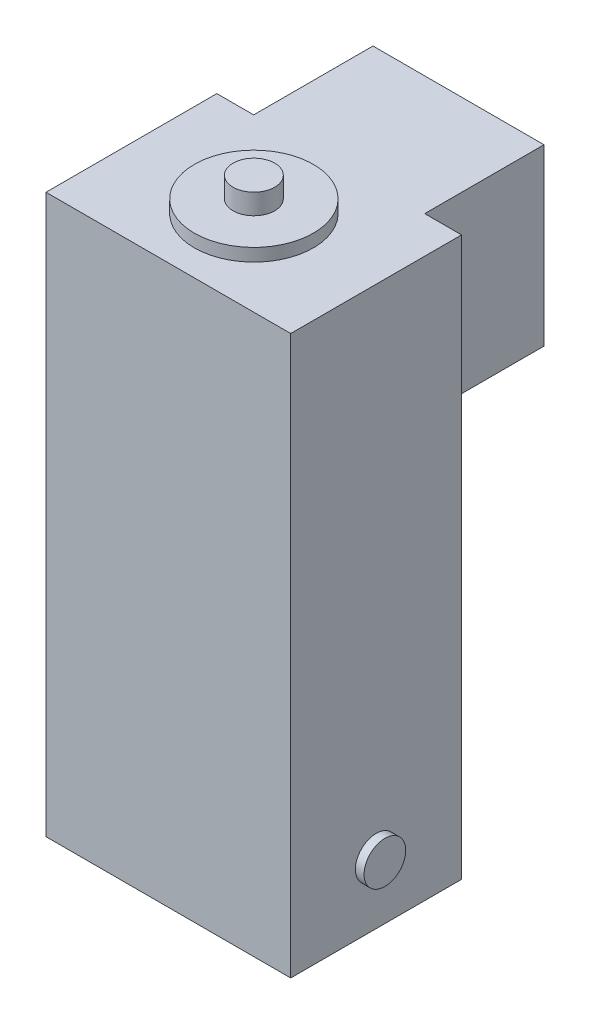
ISO-10303-21;
HEADER;
FILE_DESCRIPTION(('STEP AP214'),'2;1');
FILE_NAME('part.step','',(''),(''),'','','');
FILE_SCHEMA(('AUTOMOTIVE_DESIGN { 1 0 10303 214 1 1 1 1 }'));
ENDSEC;
DATA;
#1=APPLICATION_CONTEXT('core data for automotive mechanical design processes');
#2=APPLICATION_PROTOCOL_DEFINITION('international standard','automotive_design',2000,#1);
#3=PRODUCT_CONTEXT('',#1,'mechanical');
#4=PRODUCT('Part','Part','',(#3));
#5=PRODUCT_RELATED_PRODUCT_CATEGORY('part','',(#4));
#6=PRODUCT_DEFINITION_FORMATION('','',#4);
#7=PRODUCT_DEFINITION_CONTEXT('part definition',#1,'design');
#8=PRODUCT_DEFINITION('design','',#6,#7);
#9=PRODUCT_DEFINITION_SHAPE('','',#8);
#10=(LENGTH_UNIT() NAMED_UNIT(*) SI_UNIT(.MILLI.,.METRE.));
#11=(NAMED_UNIT(*) PLANE_ANGLE_UNIT() SI_UNIT($,.RADIAN.));
#12=(NAMED_UNIT(*) SI_UNIT($,.STERADIAN.) SOLID_ANGLE_UNIT());
#13=UNCERTAINTY_MEASURE_WITH_UNIT(LENGTH_MEASURE(1.E-05),#10,'distance_accuracy_value','');
#14=(GEOMETRIC_REPRESENTATION_CONTEXT(3) GLOBAL_UNCERTAINTY_ASSIGNED_CONTEXT((#13)) GLOBAL_UNIT_ASSIGNED_CONTEXT((#10,
#11,#12)) REPRESENTATION_CONTEXT('',''));
#15=CARTESIAN_POINT('',(0.,0.,0.));
#16=DIRECTION('',(0.,0.,1.));
#17=DIRECTION('',(1.,0.,0.));
#18=AXIS2_PLACEMENT_3D('',#15,#16,#17);
#19=CARTESIAN_POINT('',(0.,119.7,0.));
#20=DIRECTION('',(0.,1.,0.));
#21=DIRECTION('',(0.,0.,1.));
#22=AXIS2_PLACEMENT_3D('',#19,#20,#21);
#23=PLANE('',#22);
#24=CARTESIAN_POINT('',(0.,119.7,0.));
#25=DIRECTION('',(0.,1.,0.));
#26=DIRECTION('',(0.,0.,1.));
#27=AXIS2_PLACEMENT_3D('',#24,#25,#26);
#28=CIRCLE('',#27,14.);
#29=CARTESIAN_POINT('',(0.,119.7,14.));
#30=VERTEX_POINT('',#29);
#31=EDGE_CURVE('E217',#30,#30,#28,.T.);
#32=ORIENTED_EDGE('',*,*,#31,.T.);
#33=EDGE_LOOP('',(#32));
#34=FACE_BOUND('',#33,.T.);
#35=CARTESIAN_POINT('',(0.,119.7,0.));
#36=DIRECTION('',(0.,1.,0.));
#37=DIRECTION('',(0.,0.,1.));
#38=AXIS2_PLACEMENT_3D('',#35,#36,#37);
#39=CIRCLE('',#38,4.9);
#40=CARTESIAN_POINT('',(0.,119.7,4.9));
#41=VERTEX_POINT('',#40);
#42=EDGE_CURVE('E210',#41,#41,#39,.T.);
#43=ORIENTED_EDGE('',*,*,#42,.F.);
#44=EDGE_LOOP('',(#43));
#45=FACE_BOUND('',#44,.T.);
#46=ADVANCED_FACE('F33',(#34,#45),#23,.T.);
#47=CARTESIAN_POINT('',(-20.1,116.7,13.));
#48=DIRECTION('',(0.,-1.,0.));
#49=DIRECTION('',(0.,0.,-1.));
#50=AXIS2_PLACEMENT_3D('',#47,#48,#49);
#51=PLANE('',#50);
#52=DIRECTION('',(0.,0.,1.));
#53=VECTOR('',#52,1.);
#54=CARTESIAN_POINT('',(-20.1,116.7,-48.1));
#55=LINE('',#54,#53);
#56=CARTESIAN_POINT('',(-20.1,116.7,-48.1));
#57=VERTEX_POINT('',#56);
#58=CARTESIAN_POINT('',(-20.1,116.7,-20.0569195924031));
#59=VERTEX_POINT('',#58);
#60=EDGE_CURVE('E220',#57,#59,#55,.T.);
#61=ORIENTED_EDGE('',*,*,#60,.T.);
#62=DIRECTION('',(-1.,0.,0.));
#63=VECTOR('',#62,1.);
#64=CARTESIAN_POINT('',(-28.7625,116.7,-20.0569195924031));
#65=LINE('',#64,#63);
#66=CARTESIAN_POINT('',(-28.7625,116.7,-20.0569195924031));
#67=VERTEX_POINT('',#66);
#68=EDGE_CURVE('E177',#59,#67,#65,.T.);
#69=ORIENTED_EDGE('',*,*,#68,.T.);
#70=DIRECTION('',(0.,0.,1.));
#71=VECTOR('',#70,1.);
#72=CARTESIAN_POINT('',(-28.7625,116.7,20.1));
#73=LINE('',#72,#71);
#74=CARTESIAN_POINT('',(-28.7625,116.7,20.1));
#75=VERTEX_POINT('',#74);
#76=EDGE_CURVE('E181',#67,#75,#73,.T.);
#77=ORIENTED_EDGE('',*,*,#76,.T.);
#78=DIRECTION('',(1.,0.,0.));
#79=VECTOR('',#78,1.);
#80=CARTESIAN_POINT('',(-28.7625,116.7,20.1));
#81=LINE('',#80,#79);
#82=CARTESIAN_POINT('',(28.7625,116.7,20.1));
#83=VERTEX_POINT('',#82);
#84=EDGE_CURVE('E411',#75,#83,#81,.T.);
#85=ORIENTED_EDGE('',*,*,#84,.T.);
#86=DIRECTION('',(0.,0.,-1.));
#87=VECTOR('',#86,1.);
#88=CARTESIAN_POINT('',(28.7625,116.7,20.1));
#89=LINE('',#88,#87);
#90=CARTESIAN_POINT('',(28.7625,116.7,-20.0569195924031));
#91=VERTEX_POINT('',#90);
#92=EDGE_CURVE('E154',#83,#91,#89,.T.);
#93=ORIENTED_EDGE('',*,*,#92,.T.);
#94=CARTESIAN_POINT('',(20.1,116.7,-20.0569195924031));
#95=VERTEX_POINT('',#94);
#96=EDGE_CURVE('E174',#91,#95,#65,.T.);
#97=ORIENTED_EDGE('',*,*,#96,.T.);
#98=DIRECTION('',(0.,0.,-1.));
#99=VECTOR('',#98,1.);
#100=CARTESIAN_POINT('',(20.1,116.7,-48.1));
#101=LINE('',#100,#99);
#102=CARTESIAN_POINT('',(20.1,116.7,-48.1));
#103=VERTEX_POINT('',#102);
#104=EDGE_CURVE('E235',#95,#103,#101,.T.);
#105=ORIENTED_EDGE('',*,*,#104,.T.);
#106=DIRECTION('',(-1.,0.,0.));
#107=VECTOR('',#106,1.);
#108=CARTESIAN_POINT('',(20.1,116.7,-48.1));
#109=LINE('',#108,#107);
#110=EDGE_CURVE('E227',#103,#57,#109,.T.);
#111=ORIENTED_EDGE('',*,*,#110,.T.);
#112=EDGE_LOOP('',(#61,#69,#77,#85,#93,#97,#105,#111));
#113=FACE_BOUND('',#112,.T.);
#114=CARTESIAN_POINT('',(0.,116.7,0.));
#115=DIRECTION('',(0.,1.,0.));
#116=DIRECTION('',(0.,0.,1.));
#117=AXIS2_PLACEMENT_3D('',#114,#115,#116);
#118=CIRCLE('',#117,14.);
#119=CARTESIAN_POINT('',(0.,116.7,14.));
#120=VERTEX_POINT('',#119);
#121=EDGE_CURVE('E214',#120,#120,#118,.T.);
#122=ORIENTED_EDGE('',*,*,#121,.F.);
#123=EDGE_LOOP('',(#122));
#124=FACE_BOUND('',#123,.T.);
#125=ADVANCED_FACE('F309',(#113,#124),#51,.F.);
#126=CARTESIAN_POINT('',(20.1,75.7,-48.1));
#127=DIRECTION('',(1.,0.,0.));
#128=DIRECTION('',(0.,0.,-1.));
#129=AXIS2_PLACEMENT_3D('',#126,#127,#128);
#130=PLANE('',#129);
#131=DIRECTION('',(0.,1.,0.));
#132=VECTOR('',#131,1.);
#133=CARTESIAN_POINT('',(20.1,75.7,-20.0569195924031));
#134=LINE('',#133,#132);
#135=CARTESIAN_POINT('',(20.1,75.7,-20.0569195924031));
#136=VERTEX_POINT('',#135);
#137=EDGE_CURVE('E194',#136,#95,#134,.T.);
#138=ORIENTED_EDGE('',*,*,#137,.F.);
#139=DIRECTION('',(0.,0.,-1.));
#140=VECTOR('',#139,1.);
#141=CARTESIAN_POINT('',(20.1,75.7,-48.1));
#142=LINE('',#141,#140);
#143=CARTESIAN_POINT('',(20.1,75.7,-48.1));
#144=VERTEX_POINT('',#143);
#145=EDGE_CURVE('E226',#136,#144,#142,.T.);
#146=ORIENTED_EDGE('',*,*,#145,.T.);
#147=DIRECTION('',(0.,1.,0.));
#148=VECTOR('',#147,1.);
#149=CARTESIAN_POINT('',(20.1,75.7,-48.1));
#150=LINE('',#149,#148);
#151=EDGE_CURVE('E232',#144,#103,#150,.T.);
#152=ORIENTED_EDGE('',*,*,#151,.T.);
#153=ORIENTED_EDGE('',*,*,#104,.F.);
#154=EDGE_LOOP('',(#138,#146,#152,#153));
#155=FACE_BOUND('',#154,.T.);
#156=ADVANCED_FACE('F316',(#155),#130,.T.);
#157=CARTESIAN_POINT('',(-20.1,75.7,-48.1));
#158=DIRECTION('',(-1.,0.,0.));
#159=DIRECTION('',(0.,0.,1.));
#160=AXIS2_PLACEMENT_3D('',#157,#158,#159);
#161=PLANE('',#160);
#162=DIRECTION('',(0.,-1.,0.));
#163=VECTOR('',#162,1.);
#164=CARTESIAN_POINT('',(-20.1,75.7,-20.0569195924031));
#165=LINE('',#164,#163);
#166=CARTESIAN_POINT('',(-20.1,75.7,-20.0569195924031));
#167=VERTEX_POINT('',#166);
#168=EDGE_CURVE('E185',#59,#167,#165,.T.);
#169=ORIENTED_EDGE('',*,*,#168,.F.);
#170=ORIENTED_EDGE('',*,*,#60,.F.);
#171=DIRECTION('',(0.,1.,0.));
#172=VECTOR('',#171,1.);
#173=CARTESIAN_POINT('',(-20.1,75.7,-48.1));
#174=LINE('',#173,#172);
#175=CARTESIAN_POINT('',(-20.1,75.7,-48.1));
#176=VERTEX_POINT('',#175);
#177=EDGE_CURVE('E239',#176,#57,#174,.T.);
#178=ORIENTED_EDGE('',*,*,#177,.F.);
#179=DIRECTION('',(0.,0.,1.));
#180=VECTOR('',#179,1.);
#181=CARTESIAN_POINT('',(-20.1,75.7,-48.1));
#182=LINE('',#181,#180);
#183=EDGE_CURVE('E223',#176,#167,#182,.T.);
#184=ORIENTED_EDGE('',*,*,#183,.T.);
#185=EDGE_LOOP('',(#169,#170,#178,#184));
#186=FACE_BOUND('',#185,.T.);
#187=ADVANCED_FACE('F335',(#186),#161,.T.);
#188=CARTESIAN_POINT('',(20.1,75.7,-48.1));
#189=DIRECTION('',(0.,0.,-1.));
#190=DIRECTION('',(-1.,0.,0.));
#191=AXIS2_PLACEMENT_3D('',#188,#189,#190);
#192=PLANE('',#191);
#193=ORIENTED_EDGE('',*,*,#110,.F.);
#194=ORIENTED_EDGE('',*,*,#151,.F.);
#195=DIRECTION('',(-1.,0.,0.));
#196=VECTOR('',#195,1.);
#197=CARTESIAN_POINT('',(20.1,75.7,-48.1));
#198=LINE('',#197,#196);
#199=EDGE_CURVE('E229',#144,#176,#198,.T.);
#200=ORIENTED_EDGE('',*,*,#199,.T.);
#201=ORIENTED_EDGE('',*,*,#177,.T.);
#202=EDGE_LOOP('',(#193,#194,#200,#201));
#203=FACE_BOUND('',#202,.T.);
#204=ADVANCED_FACE('F330',(#203),#192,.T.);
#205=CARTESIAN_POINT('',(-20.1,75.7,13.));
#206=DIRECTION('',(0.,-1.,0.));
#207=DIRECTION('',(0.,0.,-1.));
#208=AXIS2_PLACEMENT_3D('',#205,#206,#207);
#209=PLANE('',#208);
#210=DIRECTION('',(1.,0.,0.));
#211=VECTOR('',#210,1.);
#212=CARTESIAN_POINT('',(-20.1,75.7,-20.0569195924031));
#213=LINE('',#212,#211);
#214=EDGE_CURVE('E11',#167,#136,#213,.T.);
#215=ORIENTED_EDGE('',*,*,#214,.F.);
#216=ORIENTED_EDGE('',*,*,#183,.F.);
#217=ORIENTED_EDGE('',*,*,#199,.F.);
#218=ORIENTED_EDGE('',*,*,#145,.F.);
#219=EDGE_LOOP('',(#215,#216,#217,#218));
#220=FACE_BOUND('',#219,.T.);
#221=ADVANCED_FACE('F327',(#220),#209,.T.);
#222=CARTESIAN_POINT('',(0.,119.7,0.));
#223=DIRECTION('',(0.,-1.,0.));
#224=DIRECTION('',(0.,0.,-1.));
#225=AXIS2_PLACEMENT_3D('',#222,#223,#224);
#226=CYLINDRICAL_SURFACE('',#225,14.);
#227=ORIENTED_EDGE('',*,*,#31,.F.);
#228=EDGE_LOOP('',(#227));
#229=FACE_BOUND('',#228,.T.);
#230=ORIENTED_EDGE('',*,*,#121,.T.);
#231=EDGE_LOOP('',(#230));
#232=FACE_BOUND('',#231,.T.);
#233=ADVANCED_FACE('F324',(#229,#232),#226,.T.);
#234=CARTESIAN_POINT('',(0.,124.5,0.));
#235=DIRECTION('',(0.,-1.,0.));
#236=DIRECTION('',(0.,0.,-1.));
#237=AXIS2_PLACEMENT_3D('',#234,#235,#236);
#238=CYLINDRICAL_SURFACE('',#237,4.9);
#239=CARTESIAN_POINT('',(0.,124.5,0.));
#240=DIRECTION('',(0.,1.,0.));
#241=DIRECTION('',(0.,0.,1.));
#242=AXIS2_PLACEMENT_3D('',#239,#240,#241);
#243=CIRCLE('',#242,4.9);
#244=CARTESIAN_POINT('',(0.,124.5,4.9));
#245=VERTEX_POINT('',#244);
#246=EDGE_CURVE('E211',#245,#245,#243,.T.);
#247=ORIENTED_EDGE('',*,*,#246,.F.);
#248=EDGE_LOOP('',(#247));
#249=FACE_BOUND('',#248,.T.);
#250=ORIENTED_EDGE('',*,*,#42,.T.);
#251=EDGE_LOOP('',(#250));
#252=FACE_BOUND('',#251,.T.);
#253=ADVANCED_FACE('F322',(#249,#252),#238,.T.);
#254=CARTESIAN_POINT('',(0.,124.5,0.));
#255=DIRECTION('',(0.,1.,0.));
#256=DIRECTION('',(0.,0.,1.));
#257=AXIS2_PLACEMENT_3D('',#254,#255,#256);
#258=PLANE('',#257);
#259=ORIENTED_EDGE('',*,*,#246,.T.);
#260=EDGE_LOOP('',(#259));
#261=FACE_BOUND('',#260,.T.);
#262=ADVANCED_FACE('F400',(#261),#258,.T.);
#263=CARTESIAN_POINT('',(-28.7625,-84.6548559698523,-20.0569195924031));
#264=DIRECTION('',(0.,0.,-1.));
#265=DIRECTION('',(-1.,0.,0.));
#266=AXIS2_PLACEMENT_3D('',#263,#264,#265);
#267=PLANE('',#266);
#268=DIRECTION('',(0.,1.,0.));
#269=VECTOR('',#268,1.);
#270=CARTESIAN_POINT('',(28.7625,-84.6548559698523,-20.0569195924031));
#271=LINE('',#270,#269);
#272=CARTESIAN_POINT('',(28.7625,44.6506828324669,-20.0569195924031));
#273=VERTEX_POINT('',#272);
#274=EDGE_CURVE('E170',#273,#91,#271,.T.);
#275=ORIENTED_EDGE('',*,*,#274,.F.);
#276=DIRECTION('',(1.,0.,0.));
#277=VECTOR('',#276,1.);
#278=CARTESIAN_POINT('',(-23.,44.650682832467,-20.0569195924031));
#279=LINE('',#278,#277);
#280=CARTESIAN_POINT('',(-28.7625,44.6506828324669,-20.0569195924031));
#281=VERTEX_POINT('',#280);
#282=EDGE_CURVE('E205',#273,#281,#279,.F.);
#283=ORIENTED_EDGE('',*,*,#282,.T.);
#284=DIRECTION('',(0.,1.,0.));
#285=VECTOR('',#284,1.);
#286=CARTESIAN_POINT('',(-28.7625,-84.6548559698523,-20.0569195924031));
#287=LINE('',#286,#285);
#288=EDGE_CURVE('E187',#281,#67,#287,.T.);
#289=ORIENTED_EDGE('',*,*,#288,.T.);
#290=ORIENTED_EDGE('',*,*,#68,.F.);
#291=ORIENTED_EDGE('',*,*,#168,.T.);
#292=ORIENTED_EDGE('',*,*,#214,.T.);
#293=ORIENTED_EDGE('',*,*,#137,.T.);
#294=ORIENTED_EDGE('',*,*,#96,.F.);
#295=EDGE_LOOP('',(#275,#283,#289,#290,#291,#292,#293,#294));
#296=FACE_BOUND('',#295,.T.);
#297=ADVANCED_FACE('F395',(#296),#267,.T.);
#298=CARTESIAN_POINT('',(23.,50.6,-20.1));
#299=DIRECTION('',(0.,0.,1.));
#300=DIRECTION('',(1.,0.,0.));
#301=AXIS2_PLACEMENT_3D('',#298,#299,#300);
#302=PLANE('',#301);
#303=DIRECTION('',(-1.,0.,0.));
#304=VECTOR('',#303,1.);
#305=CARTESIAN_POINT('',(23.,-8.49999999999997,-20.1));
#306=LINE('',#305,#304);
#307=CARTESIAN_POINT('',(-23.,-8.49999999999997,-20.1));
#308=VERTEX_POINT('',#307);
#309=CARTESIAN_POINT('',(23.,-8.49999999999997,-20.1));
#310=VERTEX_POINT('',#309);
#311=EDGE_CURVE('E41',#308,#310,#306,.F.);
#312=ORIENTED_EDGE('',*,*,#311,.F.);
#313=DIRECTION('',(0.,-1.,0.));
#314=VECTOR('',#313,1.);
#315=CARTESIAN_POINT('',(-23.,50.6,-20.1));
#316=LINE('',#315,#314);
#317=CARTESIAN_POINT('',(-23.,15.2,-20.1));
#318=VERTEX_POINT('',#317);
#319=EDGE_CURVE('E278',#318,#308,#316,.T.);
#320=ORIENTED_EDGE('',*,*,#319,.F.);
#321=DIRECTION('',(1.,0.,0.));
#322=VECTOR('',#321,1.);
#323=CARTESIAN_POINT('',(-24.,15.2,-20.1));
#324=LINE('',#323,#322);
#325=CARTESIAN_POINT('',(-28.7625,15.2,-20.1));
#326=VERTEX_POINT('',#325);
#327=EDGE_CURVE('E277',#326,#318,#324,.T.);
#328=ORIENTED_EDGE('',*,*,#327,.F.);
#329=DIRECTION('',(0.,1.,0.));
#330=VECTOR('',#329,1.);
#331=CARTESIAN_POINT('',(-28.7625,44.5999999999999,-20.1));
#332=LINE('',#331,#330);
#333=CARTESIAN_POINT('',(-28.7625,44.5999999999999,-20.1));
#334=VERTEX_POINT('',#333);
#335=EDGE_CURVE('E241',#326,#334,#332,.T.);
#336=ORIENTED_EDGE('',*,*,#335,.T.);
#337=DIRECTION('',(-1.,0.,0.));
#338=VECTOR('',#337,1.);
#339=CARTESIAN_POINT('',(23.,44.6,-20.1));
#340=LINE('',#339,#338);
#341=CARTESIAN_POINT('',(28.7625,44.5999999999999,-20.1));
#342=VERTEX_POINT('',#341);
#343=EDGE_CURVE('E263',#342,#334,#340,.T.);
#344=ORIENTED_EDGE('',*,*,#343,.F.);
#345=DIRECTION('',(0.,1.,0.));
#346=VECTOR('',#345,1.);
#347=CARTESIAN_POINT('',(28.7625,44.5999999999999,-20.1));
#348=LINE('',#347,#346);
#349=CARTESIAN_POINT('',(28.7625,15.2,-20.1));
#350=VERTEX_POINT('',#349);
#351=EDGE_CURVE('E252',#350,#342,#348,.T.);
#352=ORIENTED_EDGE('',*,*,#351,.F.);
#353=DIRECTION('',(-1.,0.,0.));
#354=VECTOR('',#353,1.);
#355=CARTESIAN_POINT('',(24.,15.2,-20.1));
#356=LINE('',#355,#354);
#357=CARTESIAN_POINT('',(23.,15.2,-20.1));
#358=VERTEX_POINT('',#357);
#359=EDGE_CURVE('E267',#350,#358,#356,.T.);
#360=ORIENTED_EDGE('',*,*,#359,.T.);
#361=DIRECTION('',(0.,-1.,0.));
#362=VECTOR('',#361,1.);
#363=CARTESIAN_POINT('',(23.,50.6,-20.1));
#364=LINE('',#363,#362);
#365=EDGE_CURVE('E283',#358,#310,#364,.T.);
#366=ORIENTED_EDGE('',*,*,#365,.T.);
#367=EDGE_LOOP('',(#312,#320,#328,#336,#344,#352,#360,#366));
#368=FACE_BOUND('',#367,.T.);
#369=ADVANCED_FACE('F350',(#368),#302,.F.);
#370=CARTESIAN_POINT('',(28.7625,15.2,-20.1));
#371=DIRECTION('',(-1.,0.,0.));
#372=DIRECTION('',(0.,0.,1.));
#373=AXIS2_PLACEMENT_3D('',#370,#371,#372);
#374=PLANE('',#373);
#375=CARTESIAN_POINT('',(28.7625,-14.5,-20.0569195924031));
#376=VERTEX_POINT('',#375);
#377=CARTESIAN_POINT('',(28.7625,15.2,-20.0569195924031));
#378=VERTEX_POINT('',#377);
#379=EDGE_CURVE('E188',#376,#378,#271,.T.);
#380=ORIENTED_EDGE('',*,*,#379,.T.);
#381=DIRECTION('',(0.,0.,-1.));
#382=VECTOR('',#381,1.);
#383=CARTESIAN_POINT('',(28.7625,15.2,-20.1));
#384=LINE('',#383,#382);
#385=EDGE_CURVE('E159',#378,#350,#384,.T.);
#386=ORIENTED_EDGE('',*,*,#385,.T.);
#387=ORIENTED_EDGE('',*,*,#351,.T.);
#388=DIRECTION('',(0.,0.76193931775946,0.64764842009554));
#389=VECTOR('',#388,1.);
#390=CARTESIAN_POINT('',(28.7625,57.7764705882352,-8.90000000000001));
#391=LINE('',#390,#389);
#392=EDGE_CURVE('E160',#342,#273,#391,.T.);
#393=ORIENTED_EDGE('',*,*,#392,.T.);
#394=ORIENTED_EDGE('',*,*,#274,.T.);
#395=ORIENTED_EDGE('',*,*,#92,.F.);
#396=DIRECTION('',(0.,-1.,0.));
#397=VECTOR('',#396,1.);
#398=CARTESIAN_POINT('',(28.7625,31.2,20.1));
#399=LINE('',#398,#397);
#400=CARTESIAN_POINT('',(28.7625,-14.5,20.1));
#401=VERTEX_POINT('',#400);
#402=EDGE_CURVE('E147',#83,#401,#399,.T.);
#403=ORIENTED_EDGE('',*,*,#402,.T.);
#404=DIRECTION('',(0.,0.,-1.));
#405=VECTOR('',#404,1.);
#406=CARTESIAN_POINT('',(28.7625,-14.5,20.1));
#407=LINE('',#406,#405);
#408=EDGE_CURVE('E152',#401,#376,#407,.T.);
#409=ORIENTED_EDGE('',*,*,#408,.T.);
#410=EDGE_LOOP('',(#380,#386,#387,#393,#394,#395,#403,#409));
#411=FACE_BOUND('',#410,.T.);
#412=CARTESIAN_POINT('',(28.7625,0.,0.));
#413=DIRECTION('',(1.,0.,0.));
#414=DIRECTION('',(0.,0.,-1.));
#415=AXIS2_PLACEMENT_3D('',#412,#413,#414);
#416=CIRCLE('',#415,4.9);
#417=CARTESIAN_POINT('',(28.7625,0.,-4.9));
#418=VERTEX_POINT('',#417);
#419=EDGE_CURVE('E207',#418,#418,#416,.T.);
#420=ORIENTED_EDGE('',*,*,#419,.F.);
#421=EDGE_LOOP('',(#420));
#422=FACE_BOUND('',#421,.T.);
#423=ADVANCED_FACE('F150',(#411,#422),#374,.F.);
#424=CARTESIAN_POINT('',(-23.,50.6,-15.));
#425=DIRECTION('',(0.,-0.64764842009554,0.761939317759459));
#426=DIRECTION('',(0.,0.761939317759459,0.64764842009554));
#427=AXIS2_PLACEMENT_3D('',#424,#425,#426);
#428=PLANE('',#427);
#429=ORIENTED_EDGE('',*,*,#282,.F.);
#430=ORIENTED_EDGE('',*,*,#392,.F.);
#431=ORIENTED_EDGE('',*,*,#343,.T.);
#432=DIRECTION('',(0.,0.76193931775946,0.64764842009554));
#433=VECTOR('',#432,1.);
#434=CARTESIAN_POINT('',(-28.7625,57.7764705882352,-8.90000000000001));
#435=LINE('',#434,#433);
#436=EDGE_CURVE('E249',#334,#281,#435,.T.);
#437=ORIENTED_EDGE('',*,*,#436,.T.);
#438=EDGE_LOOP('',(#429,#430,#431,#437));
#439=FACE_BOUND('',#438,.T.);
#440=ADVANCED_FACE('F349',(#439),#428,.F.);
#441=CARTESIAN_POINT('',(-24.,15.2,-20.1));
#442=DIRECTION('',(0.,1.,0.));
#443=DIRECTION('',(0.,0.,1.));
#444=AXIS2_PLACEMENT_3D('',#441,#442,#443);
#445=PLANE('',#444);
#446=DIRECTION('',(0.,0.,1.));
#447=VECTOR('',#446,1.);
#448=CARTESIAN_POINT('',(-23.,15.2,-20.1));
#449=LINE('',#448,#447);
#450=CARTESIAN_POINT('',(-23.,15.2,-20.0569195924031));
#451=VERTEX_POINT('',#450);
#452=EDGE_CURVE('E269',#318,#451,#449,.T.);
#453=ORIENTED_EDGE('',*,*,#452,.T.);
#454=DIRECTION('',(-1.,0.,0.));
#455=VECTOR('',#454,1.);
#456=CARTESIAN_POINT('',(-24.,15.2,-20.0569195924031));
#457=LINE('',#456,#455);
#458=CARTESIAN_POINT('',(-28.7625,15.2,-20.0569195924031));
#459=VERTEX_POINT('',#458);
#460=EDGE_CURVE('E203',#451,#459,#457,.T.);
#461=ORIENTED_EDGE('',*,*,#460,.T.);
#462=DIRECTION('',(0.,0.,-1.));
#463=VECTOR('',#462,1.);
#464=CARTESIAN_POINT('',(-28.7625,15.2,-20.1));
#465=LINE('',#464,#463);
#466=EDGE_CURVE('E246',#459,#326,#465,.T.);
#467=ORIENTED_EDGE('',*,*,#466,.T.);
#468=ORIENTED_EDGE('',*,*,#327,.T.);
#469=EDGE_LOOP('',(#453,#461,#467,#468));
#470=FACE_BOUND('',#469,.T.);
#471=ADVANCED_FACE('F355',(#470),#445,.F.);
#472=CARTESIAN_POINT('',(-23.,-14.5,-15.));
#473=DIRECTION('',(0.,0.64764842009554,0.761939317759459));
#474=DIRECTION('',(0.,-0.761939317759459,0.64764842009554));
#475=AXIS2_PLACEMENT_3D('',#472,#473,#474);
#476=PLANE('',#475);
#477=DIRECTION('',(-1.,0.,0.));
#478=VECTOR('',#477,1.);
#479=CARTESIAN_POINT('',(-23.,-8.55068283246696,-20.0569195924031));
#480=LINE('',#479,#478);
#481=CARTESIAN_POINT('',(-23.,-8.55068283246696,-20.0569195924031));
#482=VERTEX_POINT('',#481);
#483=CARTESIAN_POINT('',(23.,-8.55068283246696,-20.0569195924031));
#484=VERTEX_POINT('',#483);
#485=EDGE_CURVE('E196',#482,#484,#480,.F.);
#486=ORIENTED_EDGE('',*,*,#485,.F.);
#487=DIRECTION('',(0.,-0.761939317759459,0.64764842009554));
#488=VECTOR('',#487,1.);
#489=CARTESIAN_POINT('',(-23.,25.8105950653121,-49.2640058055152));
#490=LINE('',#489,#488);
#491=EDGE_CURVE('E261',#482,#308,#490,.F.);
#492=ORIENTED_EDGE('',*,*,#491,.T.);
#493=ORIENTED_EDGE('',*,*,#311,.T.);
#494=DIRECTION('',(0.,0.761939317759459,-0.64764842009554));
#495=VECTOR('',#494,1.);
#496=CARTESIAN_POINT('',(23.,25.8105950653121,-49.2640058055152));
#497=LINE('',#496,#495);
#498=EDGE_CURVE('E258',#310,#484,#497,.F.);
#499=ORIENTED_EDGE('',*,*,#498,.T.);
#500=EDGE_LOOP('',(#486,#492,#493,#499));
#501=FACE_BOUND('',#500,.T.);
#502=ADVANCED_FACE('F351',(#501),#476,.F.);
#503=CARTESIAN_POINT('',(24.,15.2,-20.1));
#504=DIRECTION('',(0.,-1.,0.));
#505=DIRECTION('',(0.,0.,-1.));
#506=AXIS2_PLACEMENT_3D('',#503,#504,#505);
#507=PLANE('',#506);
#508=DIRECTION('',(1.,0.,0.));
#509=VECTOR('',#508,1.);
#510=CARTESIAN_POINT('',(24.,15.2,-20.0569195924031));
#511=LINE('',#510,#509);
#512=CARTESIAN_POINT('',(23.,15.2,-20.0569195924031));
#513=VERTEX_POINT('',#512);
#514=EDGE_CURVE('E56',#513,#378,#511,.T.);
#515=ORIENTED_EDGE('',*,*,#514,.F.);
#516=DIRECTION('',(0.,0.,1.));
#517=VECTOR('',#516,1.);
#518=CARTESIAN_POINT('',(23.,15.2,-20.1));
#519=LINE('',#518,#517);
#520=EDGE_CURVE('E265',#358,#513,#519,.T.);
#521=ORIENTED_EDGE('',*,*,#520,.F.);
#522=ORIENTED_EDGE('',*,*,#359,.F.);
#523=ORIENTED_EDGE('',*,*,#385,.F.);
#524=EDGE_LOOP('',(#515,#521,#522,#523));
#525=FACE_BOUND('',#524,.T.);
#526=ADVANCED_FACE('F354',(#525),#507,.T.);
#527=CARTESIAN_POINT('',(23.,50.6,-20.1));
#528=DIRECTION('',(-1.,0.,0.));
#529=DIRECTION('',(0.,0.,1.));
#530=AXIS2_PLACEMENT_3D('',#527,#528,#529);
#531=PLANE('',#530);
#532=ORIENTED_EDGE('',*,*,#520,.T.);
#533=DIRECTION('',(0.,-1.,0.));
#534=VECTOR('',#533,1.);
#535=CARTESIAN_POINT('',(23.,50.6,-20.0569195924031));
#536=LINE('',#535,#534);
#537=EDGE_CURVE('E199',#513,#484,#536,.T.);
#538=ORIENTED_EDGE('',*,*,#537,.T.);
#539=ORIENTED_EDGE('',*,*,#498,.F.);
#540=ORIENTED_EDGE('',*,*,#365,.F.);
#541=EDGE_LOOP('',(#532,#538,#539,#540));
#542=FACE_BOUND('',#541,.T.);
#543=ADVANCED_FACE('F361',(#542),#531,.F.);
#544=CARTESIAN_POINT('',(-23.,50.6,-20.1));
#545=DIRECTION('',(1.,0.,0.));
#546=DIRECTION('',(0.,0.,-1.));
#547=AXIS2_PLACEMENT_3D('',#544,#545,#546);
#548=PLANE('',#547);
#549=ORIENTED_EDGE('',*,*,#491,.F.);
#550=DIRECTION('',(0.,1.,0.));
#551=VECTOR('',#550,1.);
#552=CARTESIAN_POINT('',(-23.,50.6,-20.0569195924031));
#553=LINE('',#552,#551);
#554=EDGE_CURVE('E48',#482,#451,#553,.T.);
#555=ORIENTED_EDGE('',*,*,#554,.T.);
#556=ORIENTED_EDGE('',*,*,#452,.F.);
#557=ORIENTED_EDGE('',*,*,#319,.T.);
#558=EDGE_LOOP('',(#549,#555,#556,#557));
#559=FACE_BOUND('',#558,.T.);
#560=ADVANCED_FACE('F35',(#559),#548,.F.);
#561=CARTESIAN_POINT('',(-28.7625,15.2,-20.1));
#562=DIRECTION('',(1.,0.,0.));
#563=DIRECTION('',(0.,0.,1.));
#564=AXIS2_PLACEMENT_3D('',#561,#562,#563);
#565=PLANE('',#564);
#566=ORIENTED_EDGE('',*,*,#466,.F.);
#567=CARTESIAN_POINT('',(-28.7625,-14.5,-20.0569195924031));
#568=VERTEX_POINT('',#567);
#569=EDGE_CURVE('E186',#568,#459,#287,.T.);
#570=ORIENTED_EDGE('',*,*,#569,.F.);
#571=DIRECTION('',(0.,0.,1.));
#572=VECTOR('',#571,1.);
#573=CARTESIAN_POINT('',(-28.7625,-14.5,20.1));
#574=LINE('',#573,#572);
#575=CARTESIAN_POINT('',(-28.7625,-14.5,20.1));
#576=VERTEX_POINT('',#575);
#577=EDGE_CURVE('E183',#568,#576,#574,.T.);
#578=ORIENTED_EDGE('',*,*,#577,.T.);
#579=DIRECTION('',(0.,-1.,0.));
#580=VECTOR('',#579,1.);
#581=CARTESIAN_POINT('',(-28.7625,31.2,20.1));
#582=LINE('',#581,#580);
#583=EDGE_CURVE('E173',#75,#576,#582,.T.);
#584=ORIENTED_EDGE('',*,*,#583,.F.);
#585=ORIENTED_EDGE('',*,*,#76,.F.);
#586=ORIENTED_EDGE('',*,*,#288,.F.);
#587=ORIENTED_EDGE('',*,*,#436,.F.);
#588=ORIENTED_EDGE('',*,*,#335,.F.);
#589=EDGE_LOOP('',(#566,#570,#578,#584,#585,#586,#587,#588));
#590=FACE_BOUND('',#589,.T.);
#591=ADVANCED_FACE('F343',(#590),#565,.F.);
#592=CARTESIAN_POINT('',(23.,50.6,20.1));
#593=DIRECTION('',(0.,0.,-1.));
#594=DIRECTION('',(-1.,0.,0.));
#595=AXIS2_PLACEMENT_3D('',#592,#593,#594);
#596=PLANE('',#595);
#597=ORIENTED_EDGE('',*,*,#402,.F.);
#598=ORIENTED_EDGE('',*,*,#84,.F.);
#599=ORIENTED_EDGE('',*,*,#583,.T.);
#600=DIRECTION('',(1.,0.,0.));
#601=VECTOR('',#600,1.);
#602=CARTESIAN_POINT('',(-28.7625,-14.5,20.1));
#603=LINE('',#602,#601);
#604=EDGE_CURVE('E165',#576,#401,#603,.T.);
#605=ORIENTED_EDGE('',*,*,#604,.T.);
#606=EDGE_LOOP('',(#597,#598,#599,#605));
#607=FACE_BOUND('',#606,.T.);
#608=ADVANCED_FACE('F172',(#607),#596,.F.);
#609=ORIENTED_EDGE('',*,*,#460,.F.);
#610=ORIENTED_EDGE('',*,*,#554,.F.);
#611=ORIENTED_EDGE('',*,*,#485,.T.);
#612=ORIENTED_EDGE('',*,*,#537,.F.);
#613=ORIENTED_EDGE('',*,*,#514,.T.);
#614=ORIENTED_EDGE('',*,*,#379,.F.);
#615=DIRECTION('',(-1.,0.,0.));
#616=VECTOR('',#615,1.);
#617=CARTESIAN_POINT('',(-28.7625,-14.5,-20.0569195924031));
#618=LINE('',#617,#616);
#619=EDGE_CURVE('E168',#376,#568,#618,.T.);
#620=ORIENTED_EDGE('',*,*,#619,.T.);
#621=ORIENTED_EDGE('',*,*,#569,.T.);
#622=EDGE_LOOP('',(#609,#610,#611,#612,#613,#614,#620,#621));
#623=FACE_BOUND('',#622,.T.);
#624=ADVANCED_FACE('F370',(#623),#267,.T.);
#625=CARTESIAN_POINT('',(-23.,-14.5,20.1));
#626=DIRECTION('',(0.,-1.,0.));
#627=DIRECTION('',(0.,0.,-1.));
#628=AXIS2_PLACEMENT_3D('',#625,#626,#627);
#629=PLANE('',#628);
#630=ORIENTED_EDGE('',*,*,#577,.F.);
#631=ORIENTED_EDGE('',*,*,#619,.F.);
#632=ORIENTED_EDGE('',*,*,#408,.F.);
#633=ORIENTED_EDGE('',*,*,#604,.F.);
#634=EDGE_LOOP('',(#630,#631,#632,#633));
#635=FACE_BOUND('',#634,.T.);
#636=ADVANCED_FACE('F164',(#635),#629,.T.);
#637=CARTESIAN_POINT('',(30.8,0.,0.));
#638=DIRECTION('',(1.,0.,0.));
#639=DIRECTION('',(0.,0.,-1.));
#640=AXIS2_PLACEMENT_3D('',#637,#638,#639);
#641=PLANE('',#640);
#642=CARTESIAN_POINT('',(30.8,0.,0.));
#643=DIRECTION('',(1.,0.,0.));
#644=DIRECTION('',(0.,0.,-1.));
#645=AXIS2_PLACEMENT_3D('',#642,#643,#644);
#646=CIRCLE('',#645,4.9);
#647=CARTESIAN_POINT('',(30.8,0.,-4.9));
#648=VERTEX_POINT('',#647);
#649=EDGE_CURVE('E272',#648,#648,#646,.T.);
#650=ORIENTED_EDGE('',*,*,#649,.T.);
#651=EDGE_LOOP('',(#650));
#652=FACE_BOUND('',#651,.T.);
#653=ADVANCED_FACE('F296',(#652),#641,.T.);
#654=CARTESIAN_POINT('',(30.8,0.,0.));
#655=DIRECTION('',(-1.,0.,0.));
#656=DIRECTION('',(0.,0.,1.));
#657=AXIS2_PLACEMENT_3D('',#654,#655,#656);
#658=CYLINDRICAL_SURFACE('',#657,4.9);
#659=ORIENTED_EDGE('',*,*,#419,.T.);
#660=EDGE_LOOP('',(#659));
#661=FACE_BOUND('',#660,.T.);
#662=ORIENTED_EDGE('',*,*,#649,.F.);
#663=EDGE_LOOP('',(#662));
#664=FACE_BOUND('',#663,.T.);
#665=ADVANCED_FACE('F298',(#661,#664),#658,.T.);
#666=CLOSED_SHELL('',(#46,#125,#156,#187,#204,#221,#233,#253,#262,#297,#369,#423,#440,#471,#502,
#526,#543,#560,#591,#608,#624,#636,#653,#665));
#667=MANIFOLD_SOLID_BREP('B2',#666);
#668=ADVANCED_BREP_SHAPE_REPRESENTATION('',(#18,#667),#14);
#669=SHAPE_DEFINITION_REPRESENTATION(#9,#668);
ENDSEC;
END-ISO-10303-21;
